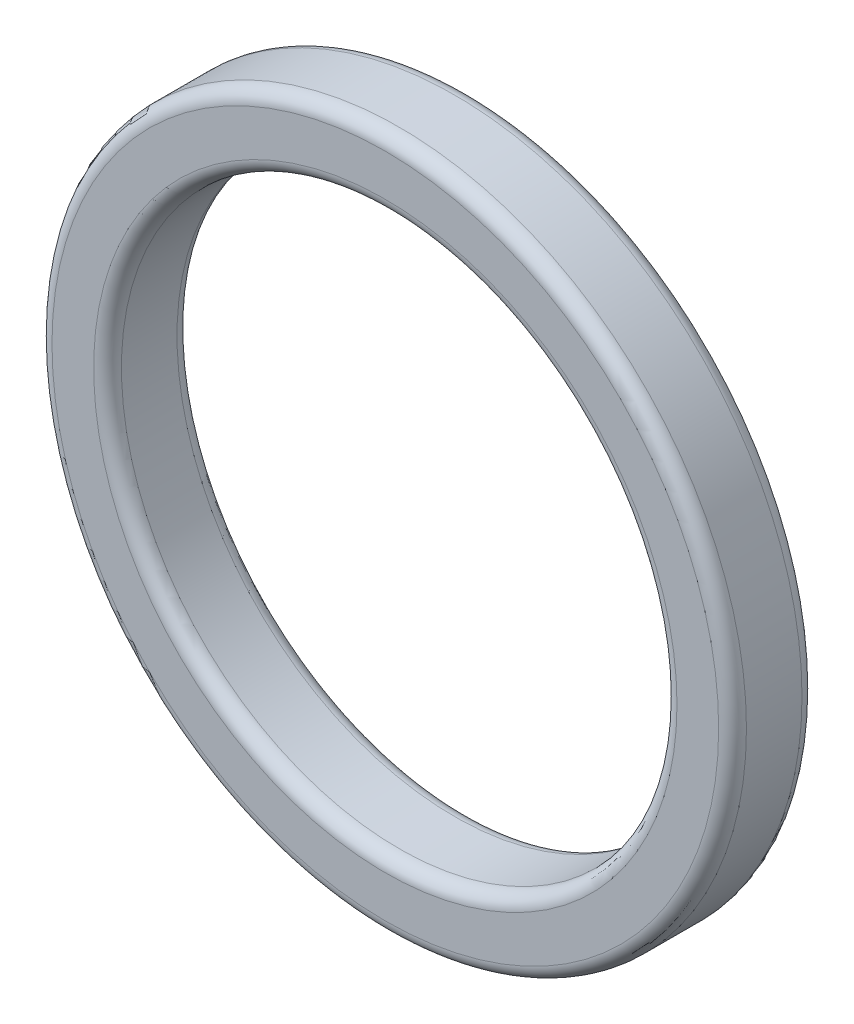
ISO-10303-21;
HEADER;
FILE_DESCRIPTION(('STEP AP214'),'2;1');
FILE_NAME('part.step','',(''),(''),'','','');
FILE_SCHEMA(('AUTOMOTIVE_DESIGN { 1 0 10303 214 1 1 1 1 }'));
ENDSEC;
DATA;
#1=APPLICATION_CONTEXT('core data for automotive mechanical design processes');
#2=APPLICATION_PROTOCOL_DEFINITION('international standard','automotive_design',2000,#1);
#3=PRODUCT_CONTEXT('',#1,'mechanical');
#4=PRODUCT('Part','Part','',(#3));
#5=PRODUCT_RELATED_PRODUCT_CATEGORY('part','',(#4));
#6=PRODUCT_DEFINITION_FORMATION('','',#4);
#7=PRODUCT_DEFINITION_CONTEXT('part definition',#1,'design');
#8=PRODUCT_DEFINITION('design','',#6,#7);
#9=PRODUCT_DEFINITION_SHAPE('','',#8);
#10=(LENGTH_UNIT() NAMED_UNIT(*) SI_UNIT(.MILLI.,.METRE.));
#11=(NAMED_UNIT(*) PLANE_ANGLE_UNIT() SI_UNIT($,.RADIAN.));
#12=(NAMED_UNIT(*) SI_UNIT($,.STERADIAN.) SOLID_ANGLE_UNIT());
#13=UNCERTAINTY_MEASURE_WITH_UNIT(LENGTH_MEASURE(1.E-05),#10,'distance_accuracy_value','');
#14=(GEOMETRIC_REPRESENTATION_CONTEXT(3) GLOBAL_UNCERTAINTY_ASSIGNED_CONTEXT((#13)) GLOBAL_UNIT_ASSIGNED_CONTEXT((#10,
#11,#12)) REPRESENTATION_CONTEXT('',''));
#15=CARTESIAN_POINT('',(0.,0.,0.));
#16=DIRECTION('',(0.,0.,1.));
#17=DIRECTION('',(1.,0.,0.));
#18=AXIS2_PLACEMENT_3D('',#15,#16,#17);
#19=CARTESIAN_POINT('',(0.,0.,6.));
#20=DIRECTION('',(0.,0.,1.));
#21=DIRECTION('',(1.,0.,0.));
#22=AXIS2_PLACEMENT_3D('',#19,#20,#21);
#23=PLANE('',#22);
#24=CARTESIAN_POINT('',(0.,0.,6.));
#25=DIRECTION('',(0.,0.,1.));
#26=DIRECTION('',(1.,0.,0.));
#27=AXIS2_PLACEMENT_3D('',#24,#25,#26);
#28=CIRCLE('',#27,21.);
#29=CARTESIAN_POINT('',(21.,0.,6.));
#30=VERTEX_POINT('',#29);
#31=EDGE_CURVE('E44',#30,#30,#28,.F.);
#32=ORIENTED_EDGE('',*,*,#31,.T.);
#33=EDGE_LOOP('',(#32));
#34=FACE_BOUND('',#33,.T.);
#35=CARTESIAN_POINT('',(0.,0.,6.));
#36=DIRECTION('',(0.,0.,1.));
#37=DIRECTION('',(1.,0.,0.));
#38=AXIS2_PLACEMENT_3D('',#35,#36,#37);
#39=CIRCLE('',#38,24.);
#40=CARTESIAN_POINT('',(24.,0.,6.));
#41=VERTEX_POINT('',#40);
#42=EDGE_CURVE('E48',#41,#41,#39,.T.);
#43=ORIENTED_EDGE('',*,*,#42,.T.);
#44=EDGE_LOOP('',(#43));
#45=FACE_BOUND('',#44,.T.);
#46=ADVANCED_FACE('F33',(#34,#45),#23,.T.);
#47=CARTESIAN_POINT('',(0.,0.,0.));
#48=DIRECTION('',(0.,0.,1.));
#49=DIRECTION('',(1.,0.,0.));
#50=AXIS2_PLACEMENT_3D('',#47,#48,#49);
#51=PLANE('',#50);
#52=CARTESIAN_POINT('',(0.,0.,0.));
#53=DIRECTION('',(0.,0.,1.));
#54=DIRECTION('',(1.,0.,0.));
#55=AXIS2_PLACEMENT_3D('',#52,#53,#54);
#56=CIRCLE('',#55,21.);
#57=CARTESIAN_POINT('',(21.,0.,0.));
#58=VERTEX_POINT('',#57);
#59=EDGE_CURVE('E59',#58,#58,#56,.T.);
#60=ORIENTED_EDGE('',*,*,#59,.T.);
#61=EDGE_LOOP('',(#60));
#62=FACE_BOUND('',#61,.T.);
#63=CARTESIAN_POINT('',(0.,0.,0.));
#64=DIRECTION('',(0.,0.,1.));
#65=DIRECTION('',(1.,0.,0.));
#66=AXIS2_PLACEMENT_3D('',#63,#64,#65);
#67=CIRCLE('',#66,24.);
#68=CARTESIAN_POINT('',(24.,0.,0.));
#69=VERTEX_POINT('',#68);
#70=EDGE_CURVE('E62',#69,#69,#67,.F.);
#71=ORIENTED_EDGE('',*,*,#70,.T.);
#72=EDGE_LOOP('',(#71));
#73=FACE_BOUND('',#72,.T.);
#74=ADVANCED_FACE('F66',(#62,#73),#51,.F.);
#75=CARTESIAN_POINT('',(0.,0.,6.));
#76=DIRECTION('',(0.,0.,-1.));
#77=DIRECTION('',(-1.,0.,0.));
#78=AXIS2_PLACEMENT_3D('',#75,#76,#77);
#79=CYLINDRICAL_SURFACE('',#78,25.);
#80=CARTESIAN_POINT('',(0.,0.,1.));
#81=DIRECTION('',(0.,0.,1.));
#82=DIRECTION('',(1.,0.,0.));
#83=AXIS2_PLACEMENT_3D('',#80,#81,#82);
#84=CIRCLE('',#83,25.);
#85=CARTESIAN_POINT('',(25.,0.,1.));
#86=VERTEX_POINT('',#85);
#87=EDGE_CURVE('E10',#86,#86,#84,.T.);
#88=ORIENTED_EDGE('',*,*,#87,.T.);
#89=EDGE_LOOP('',(#88));
#90=FACE_BOUND('',#89,.T.);
#91=CARTESIAN_POINT('',(0.,0.,5.));
#92=DIRECTION('',(0.,0.,1.));
#93=DIRECTION('',(1.,0.,0.));
#94=AXIS2_PLACEMENT_3D('',#91,#92,#93);
#95=CIRCLE('',#94,25.);
#96=CARTESIAN_POINT('',(25.,0.,5.));
#97=VERTEX_POINT('',#96);
#98=EDGE_CURVE('E40',#97,#97,#95,.F.);
#99=ORIENTED_EDGE('',*,*,#98,.T.);
#100=EDGE_LOOP('',(#99));
#101=FACE_BOUND('',#100,.T.);
#102=ADVANCED_FACE('F86',(#90,#101),#79,.T.);
#103=CARTESIAN_POINT('',(0.,0.,6.));
#104=DIRECTION('',(0.,0.,-1.));
#105=DIRECTION('',(-1.,0.,0.));
#106=AXIS2_PLACEMENT_3D('',#103,#104,#105);
#107=CYLINDRICAL_SURFACE('',#106,20.);
#108=CARTESIAN_POINT('',(0.,0.,1.));
#109=DIRECTION('',(0.,0.,1.));
#110=DIRECTION('',(1.,0.,0.));
#111=AXIS2_PLACEMENT_3D('',#108,#109,#110);
#112=CIRCLE('',#111,20.);
#113=CARTESIAN_POINT('',(20.,0.,1.));
#114=VERTEX_POINT('',#113);
#115=EDGE_CURVE('E53',#114,#114,#112,.F.);
#116=ORIENTED_EDGE('',*,*,#115,.T.);
#117=EDGE_LOOP('',(#116));
#118=FACE_BOUND('',#117,.T.);
#119=CARTESIAN_POINT('',(0.,0.,5.));
#120=DIRECTION('',(0.,0.,1.));
#121=DIRECTION('',(1.,0.,0.));
#122=AXIS2_PLACEMENT_3D('',#119,#120,#121);
#123=CIRCLE('',#122,20.);
#124=CARTESIAN_POINT('',(20.,0.,5.));
#125=VERTEX_POINT('',#124);
#126=EDGE_CURVE('E56',#125,#125,#123,.T.);
#127=ORIENTED_EDGE('',*,*,#126,.T.);
#128=EDGE_LOOP('',(#127));
#129=FACE_BOUND('',#128,.T.);
#130=ADVANCED_FACE('F91',(#118,#129),#107,.F.);
#131=CARTESIAN_POINT('',(0.,0.,1.));
#132=DIRECTION('',(0.,0.,1.));
#133=DIRECTION('',(1.,0.,0.));
#134=AXIS2_PLACEMENT_3D('',#131,#132,#133);
#135=TOROIDAL_SURFACE('',#134,21.,1.);
#136=ORIENTED_EDGE('',*,*,#115,.F.);
#137=EDGE_LOOP('',(#136));
#138=FACE_BOUND('',#137,.T.);
#139=ORIENTED_EDGE('',*,*,#59,.F.);
#140=EDGE_LOOP('',(#139));
#141=FACE_BOUND('',#140,.T.);
#142=ADVANCED_FACE('F77',(#138,#141),#135,.T.);
#143=CARTESIAN_POINT('',(0.,0.,5.));
#144=DIRECTION('',(0.,0.,1.));
#145=DIRECTION('',(1.,0.,0.));
#146=AXIS2_PLACEMENT_3D('',#143,#144,#145);
#147=TOROIDAL_SURFACE('',#146,21.,1.);
#148=ORIENTED_EDGE('',*,*,#31,.F.);
#149=EDGE_LOOP('',(#148));
#150=FACE_BOUND('',#149,.T.);
#151=ORIENTED_EDGE('',*,*,#126,.F.);
#152=EDGE_LOOP('',(#151));
#153=FACE_BOUND('',#152,.T.);
#154=ADVANCED_FACE('F71',(#150,#153),#147,.T.);
#155=CARTESIAN_POINT('',(0.,0.,1.));
#156=DIRECTION('',(0.,0.,1.));
#157=DIRECTION('',(1.,0.,0.));
#158=AXIS2_PLACEMENT_3D('',#155,#156,#157);
#159=TOROIDAL_SURFACE('',#158,24.,1.);
#160=ORIENTED_EDGE('',*,*,#70,.F.);
#161=EDGE_LOOP('',(#160));
#162=FACE_BOUND('',#161,.T.);
#163=ORIENTED_EDGE('',*,*,#87,.F.);
#164=EDGE_LOOP('',(#163));
#165=FACE_BOUND('',#164,.T.);
#166=ADVANCED_FACE('F68',(#162,#165),#159,.T.);
#167=CARTESIAN_POINT('',(0.,0.,5.));
#168=DIRECTION('',(0.,0.,1.));
#169=DIRECTION('',(1.,0.,0.));
#170=AXIS2_PLACEMENT_3D('',#167,#168,#169);
#171=TOROIDAL_SURFACE('',#170,24.,1.);
#172=ORIENTED_EDGE('',*,*,#98,.F.);
#173=EDGE_LOOP('',(#172));
#174=FACE_BOUND('',#173,.T.);
#175=ORIENTED_EDGE('',*,*,#42,.F.);
#176=EDGE_LOOP('',(#175));
#177=FACE_BOUND('',#176,.T.);
#178=ADVANCED_FACE('F35',(#174,#177),#171,.T.);
#179=CLOSED_SHELL('',(#46,#74,#102,#130,#142,#154,#166,#178));
#180=MANIFOLD_SOLID_BREP('B2',#179);
#181=ADVANCED_BREP_SHAPE_REPRESENTATION('',(#18,#180),#14);
#182=SHAPE_DEFINITION_REPRESENTATION(#9,#181);
ENDSEC;
END-ISO-10303-21;
